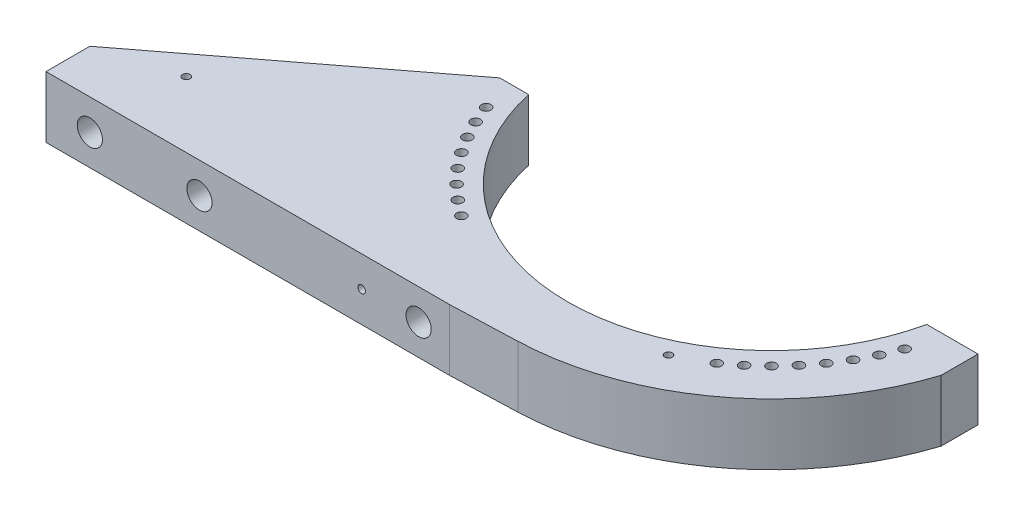
ISO-10303-21;
HEADER;
FILE_DESCRIPTION(('STEP AP214'),'2;1');
FILE_NAME('part.step','',(''),(''),'','','');
FILE_SCHEMA(('AUTOMOTIVE_DESIGN { 1 0 10303 214 1 1 1 1 }'));
ENDSEC;
DATA;
#1=APPLICATION_CONTEXT('core data for automotive mechanical design processes');
#2=APPLICATION_PROTOCOL_DEFINITION('international standard','automotive_design',2000,#1);
#3=PRODUCT_CONTEXT('',#1,'mechanical');
#4=PRODUCT('Part','Part','',(#3));
#5=PRODUCT_RELATED_PRODUCT_CATEGORY('part','',(#4));
#6=PRODUCT_DEFINITION_FORMATION('','',#4);
#7=PRODUCT_DEFINITION_CONTEXT('part definition',#1,'design');
#8=PRODUCT_DEFINITION('design','',#6,#7);
#9=PRODUCT_DEFINITION_SHAPE('','',#8);
#10=(LENGTH_UNIT() NAMED_UNIT(*) SI_UNIT(.MILLI.,.METRE.));
#11=(NAMED_UNIT(*) PLANE_ANGLE_UNIT() SI_UNIT($,.RADIAN.));
#12=(NAMED_UNIT(*) SI_UNIT($,.STERADIAN.) SOLID_ANGLE_UNIT());
#13=UNCERTAINTY_MEASURE_WITH_UNIT(LENGTH_MEASURE(1.E-05),#10,'distance_accuracy_value','');
#14=(GEOMETRIC_REPRESENTATION_CONTEXT(3) GLOBAL_UNCERTAINTY_ASSIGNED_CONTEXT((#13)) GLOBAL_UNIT_ASSIGNED_CONTEXT((#10,
#11,#12)) REPRESENTATION_CONTEXT('',''));
#15=CARTESIAN_POINT('',(0.,0.,0.));
#16=DIRECTION('',(0.,0.,1.));
#17=DIRECTION('',(1.,0.,0.));
#18=AXIS2_PLACEMENT_3D('',#15,#16,#17);
#19=CARTESIAN_POINT('',(-1050.,140.,100.));
#20=DIRECTION('',(0.,0.,-1.));
#21=DIRECTION('',(-1.,0.,0.));
#22=AXIS2_PLACEMENT_3D('',#19,#20,#21);
#23=PLANE('',#22);
#24=DIRECTION('',(1.,0.,0.));
#25=VECTOR('',#24,1.);
#26=CARTESIAN_POINT('',(-1050.,0.,100.));
#27=LINE('',#26,#25);
#28=CARTESIAN_POINT('',(-520.,0.,100.));
#29=VERTEX_POINT('',#28);
#30=CARTESIAN_POINT('',(-454.120028186382,0.,100.));
#31=VERTEX_POINT('',#30);
#32=EDGE_CURVE('E121',#29,#31,#27,.T.);
#33=ORIENTED_EDGE('',*,*,#32,.F.);
#34=DIRECTION('',(0.,-1.,0.));
#35=VECTOR('',#34,1.);
#36=CARTESIAN_POINT('',(-520.,2019.18919371118,100.));
#37=LINE('',#36,#35);
#38=CARTESIAN_POINT('',(-520.,140.,100.));
#39=VERTEX_POINT('',#38);
#40=EDGE_CURVE('E122',#39,#29,#37,.T.);
#41=ORIENTED_EDGE('',*,*,#40,.F.);
#42=DIRECTION('',(1.,0.,0.));
#43=VECTOR('',#42,1.);
#44=CARTESIAN_POINT('',(-1050.,140.,100.));
#45=LINE('',#44,#43);
#46=CARTESIAN_POINT('',(-454.120028186382,140.,100.));
#47=VERTEX_POINT('',#46);
#48=EDGE_CURVE('E336',#39,#47,#45,.T.);
#49=ORIENTED_EDGE('',*,*,#48,.T.);
#50=DIRECTION('',(0.,-1.,0.));
#51=VECTOR('',#50,1.);
#52=CARTESIAN_POINT('',(-454.120028186382,140.,100.));
#53=LINE('',#52,#51);
#54=EDGE_CURVE('E25',#47,#31,#53,.T.);
#55=ORIENTED_EDGE('',*,*,#54,.T.);
#56=EDGE_LOOP('',(#33,#41,#49,#55));
#57=FACE_BOUND('',#56,.T.);
#58=ADVANCED_FACE('F18',(#57),#23,.T.);
#59=CARTESIAN_POINT('',(-1050.,140.,100.));
#60=DIRECTION('',(-1.,0.,0.));
#61=DIRECTION('',(0.,0.,1.));
#62=AXIS2_PLACEMENT_3D('',#59,#60,#61);
#63=PLANE('',#62);
#64=DIRECTION('',(0.,0.,-1.));
#65=VECTOR('',#64,1.);
#66=CARTESIAN_POINT('',(-1050.,140.,100.));
#67=LINE('',#66,#65);
#68=CARTESIAN_POINT('',(-1050.,140.,605.));
#69=VERTEX_POINT('',#68);
#70=CARTESIAN_POINT('',(-1050.,140.,505.));
#71=VERTEX_POINT('',#70);
#72=EDGE_CURVE('E151',#69,#71,#67,.T.);
#73=ORIENTED_EDGE('',*,*,#72,.T.);
#74=DIRECTION('',(0.,-1.,0.));
#75=VECTOR('',#74,1.);
#76=CARTESIAN_POINT('',(-1050.,2019.18919371118,505.));
#77=LINE('',#76,#75);
#78=CARTESIAN_POINT('',(-1050.,0.,505.));
#79=VERTEX_POINT('',#78);
#80=EDGE_CURVE('E242',#71,#79,#77,.T.);
#81=ORIENTED_EDGE('',*,*,#80,.T.);
#82=DIRECTION('',(0.,0.,-1.));
#83=VECTOR('',#82,1.);
#84=CARTESIAN_POINT('',(-1050.,0.,100.));
#85=LINE('',#84,#83);
#86=CARTESIAN_POINT('',(-1050.,0.,605.));
#87=VERTEX_POINT('',#86);
#88=EDGE_CURVE('E145',#87,#79,#85,.T.);
#89=ORIENTED_EDGE('',*,*,#88,.F.);
#90=DIRECTION('',(0.,-1.,0.));
#91=VECTOR('',#90,1.);
#92=CARTESIAN_POINT('',(-1050.,140.,605.));
#93=LINE('',#92,#91);
#94=EDGE_CURVE('E147',#69,#87,#93,.T.);
#95=ORIENTED_EDGE('',*,*,#94,.F.);
#96=EDGE_LOOP('',(#73,#81,#89,#95));
#97=FACE_BOUND('',#96,.T.);
#98=ADVANCED_FACE('F111',(#97),#63,.T.);
#99=CARTESIAN_POINT('',(0.,140.,0.));
#100=DIRECTION('',(0.,1.,0.));
#101=DIRECTION('',(0.,0.,1.));
#102=AXIS2_PLACEMENT_3D('',#99,#100,#101);
#103=PLANE('',#102);
#104=CARTESIAN_POINT('',(220.,140.,455.));
#105=DIRECTION('',(0.,1.,0.));
#106=DIRECTION('',(0.,0.,1.));
#107=AXIS2_PLACEMENT_3D('',#104,#105,#106);
#108=CIRCLE('',#107,8.647);
#109=CARTESIAN_POINT('',(220.,140.,463.647));
#110=VERTEX_POINT('',#109);
#111=EDGE_CURVE('E386',#110,#110,#108,.T.);
#112=ORIENTED_EDGE('',*,*,#111,.F.);
#113=EDGE_LOOP('',(#112));
#114=FACE_BOUND('',#113,.T.);
#115=CARTESIAN_POINT('',(-880.,140.,455.));
#116=DIRECTION('',(0.,1.,0.));
#117=DIRECTION('',(0.,0.,1.));
#118=AXIS2_PLACEMENT_3D('',#115,#116,#117);
#119=CIRCLE('',#118,8.647);
#120=CARTESIAN_POINT('',(-880.,140.,463.647));
#121=VERTEX_POINT('',#120);
#122=EDGE_CURVE('E373',#121,#121,#119,.T.);
#123=ORIENTED_EDGE('',*,*,#122,.F.);
#124=EDGE_LOOP('',(#123));
#125=FACE_BOUND('',#124,.T.);
#126=DIRECTION('',(0.,0.,1.));
#127=VECTOR('',#126,1.);
#128=CARTESIAN_POINT('',(571.,140.,7.52182918192619E-13));
#129=LINE('',#128,#127);
#130=CARTESIAN_POINT('',(571.,140.,100.));
#131=VERTEX_POINT('',#130);
#132=CARTESIAN_POINT('',(571.,140.,184.279678749448));
#133=VERTEX_POINT('',#132);
#134=EDGE_CURVE('E360',#131,#133,#129,.T.);
#135=ORIENTED_EDGE('',*,*,#134,.F.);
#136=DIRECTION('',(1.,0.,0.));
#137=VECTOR('',#136,1.);
#138=CARTESIAN_POINT('',(454.120028186382,140.,100.));
#139=LINE('',#138,#137);
#140=CARTESIAN_POINT('',(454.120028186382,140.,100.));
#141=VERTEX_POINT('',#140);
#142=EDGE_CURVE('E335',#141,#131,#139,.T.);
#143=ORIENTED_EDGE('',*,*,#142,.F.);
#144=CARTESIAN_POINT('',(0.,140.,0.));
#145=DIRECTION('',(0.,1.,0.));
#146=DIRECTION('',(1.,0.,0.));
#147=AXIS2_PLACEMENT_3D('',#144,#145,#146);
#148=CIRCLE('',#147,465.);
#149=EDGE_CURVE('E157',#47,#141,#148,.T.);
#150=ORIENTED_EDGE('',*,*,#149,.F.);
#151=ORIENTED_EDGE('',*,*,#48,.F.);
#152=DIRECTION('',(-0.794570551349653,0.,0.607171836408697));
#153=VECTOR('',#152,1.);
#154=CARTESIAN_POINT('',(-143.457886160589,140.,-187.735011518795));
#155=LINE('',#154,#153);
#156=EDGE_CURVE('E40',#39,#71,#155,.T.);
#157=ORIENTED_EDGE('',*,*,#156,.T.);
#158=ORIENTED_EDGE('',*,*,#72,.F.);
#159=DIRECTION('',(-1.,0.,0.));
#160=VECTOR('',#159,1.);
#161=CARTESIAN_POINT('',(-1050.,140.,605.));
#162=LINE('',#161,#160);
#163=CARTESIAN_POINT('',(-130.,140.,605.));
#164=VERTEX_POINT('',#163);
#165=EDGE_CURVE('E338',#164,#69,#162,.T.);
#166=ORIENTED_EDGE('',*,*,#165,.F.);
#167=DIRECTION('',(-0.99936881924305,0.,0.0355241203234221));
#168=VECTOR('',#167,1.);
#169=CARTESIAN_POINT('',(21.3144721940532,140.,599.62129154583));
#170=LINE('',#169,#168);
#171=CARTESIAN_POINT('',(21.3144721940539,140.,599.62129154583));
#172=VERTEX_POINT('',#171);
#173=EDGE_CURVE('E362',#172,#164,#170,.T.);
#174=ORIENTED_EDGE('',*,*,#173,.F.);
#175=CARTESIAN_POINT('',(0.,140.,0.));
#176=DIRECTION('',(0.,1.,0.));
#177=DIRECTION('',(0.,0.,1.));
#178=AXIS2_PLACEMENT_3D('',#175,#176,#177);
#179=CIRCLE('',#178,600.);
#180=EDGE_CURVE('E358',#133,#172,#179,.F.);
#181=ORIENTED_EDGE('',*,*,#180,.F.);
#182=EDGE_LOOP('',(#135,#143,#150,#151,#157,#158,#166,#174,#181));
#183=FACE_BOUND('',#182,.T.);
#184=CARTESIAN_POINT('',(477.363851359241,140.,173.74623280944));
#185=DIRECTION('',(0.,1.,0.));
#186=DIRECTION('',(0.,0.,1.));
#187=AXIS2_PLACEMENT_3D('',#184,#185,#186);
#188=CIRCLE('',#187,11.);
#189=CARTESIAN_POINT('',(477.363851359241,140.,184.74623280944));
#190=VERTEX_POINT('',#189);
#191=EDGE_CURVE('E317',#190,#190,#188,.T.);
#192=ORIENTED_EDGE('',*,*,#191,.F.);
#193=EDGE_LOOP('',(#192));
#194=FACE_BOUND('',#193,.T.);
#195=CARTESIAN_POINT('',(460.404355814618,140.,214.690076964276));
#196=DIRECTION('',(0.,1.,0.));
#197=DIRECTION('',(0.,0.,1.));
#198=AXIS2_PLACEMENT_3D('',#195,#196,#197);
#199=CIRCLE('',#198,11.);
#200=CARTESIAN_POINT('',(460.404355814618,140.,225.690076964276));
#201=VERTEX_POINT('',#200);
#202=EDGE_CURVE('E312',#201,#201,#199,.T.);
#203=ORIENTED_EDGE('',*,*,#202,.F.);
#204=EDGE_LOOP('',(#203));
#205=FACE_BOUND('',#204,.T.);
#206=CARTESIAN_POINT('',(439.940905122494,140.,254.));
#207=DIRECTION('',(0.,1.,0.));
#208=DIRECTION('',(0.,0.,1.));
#209=AXIS2_PLACEMENT_3D('',#206,#207,#208);
#210=CIRCLE('',#209,11.);
#211=CARTESIAN_POINT('',(439.940905122494,140.,265.));
#212=VERTEX_POINT('',#211);
#213=EDGE_CURVE('E307',#212,#212,#210,.T.);
#214=ORIENTED_EDGE('',*,*,#213,.F.);
#215=EDGE_LOOP('',(#214));
#216=FACE_BOUND('',#215,.T.);
#217=CARTESIAN_POINT('',(416.129238498807,140.,291.376829666333));
#218=DIRECTION('',(0.,1.,0.));
#219=DIRECTION('',(0.,0.,1.));
#220=AXIS2_PLACEMENT_3D('',#217,#218,#219);
#221=CIRCLE('',#220,11.);
#222=CARTESIAN_POINT('',(416.129238498807,140.,302.376829666333));
#223=VERTEX_POINT('',#222);
#224=EDGE_CURVE('E302',#223,#223,#221,.T.);
#225=ORIENTED_EDGE('',*,*,#224,.F.);
#226=EDGE_LOOP('',(#225));
#227=FACE_BOUND('',#226,.T.);
#228=CARTESIAN_POINT('',(389.150577104439,140.,326.536105720764));
#229=DIRECTION('',(0.,1.,0.));
#230=DIRECTION('',(0.,0.,1.));
#231=AXIS2_PLACEMENT_3D('',#228,#229,#230);
#232=CIRCLE('',#231,11.);
#233=CARTESIAN_POINT('',(389.150577104439,140.,337.536105720764));
#234=VERTEX_POINT('',#233);
#235=EDGE_CURVE('E297',#234,#234,#232,.T.);
#236=ORIENTED_EDGE('',*,*,#235,.F.);
#237=EDGE_LOOP('',(#236));
#238=FACE_BOUND('',#237,.T.);
#239=CARTESIAN_POINT('',(359.210244842764,140.,359.210244842768));
#240=DIRECTION('',(0.,1.,0.));
#241=DIRECTION('',(0.,0.,1.));
#242=AXIS2_PLACEMENT_3D('',#239,#240,#241);
#243=CIRCLE('',#242,11.);
#244=CARTESIAN_POINT('',(359.210244842764,140.,370.210244842768));
#245=VERTEX_POINT('',#244);
#246=EDGE_CURVE('E292',#245,#245,#243,.T.);
#247=ORIENTED_EDGE('',*,*,#246,.F.);
#248=EDGE_LOOP('',(#247));
#249=FACE_BOUND('',#248,.T.);
#250=CARTESIAN_POINT('',(326.536105720759,140.,389.150577104444));
#251=DIRECTION('',(0.,1.,0.));
#252=DIRECTION('',(0.,0.,1.));
#253=AXIS2_PLACEMENT_3D('',#250,#251,#252);
#254=CIRCLE('',#253,11.);
#255=CARTESIAN_POINT('',(326.536105720759,140.,400.150577104444));
#256=VERTEX_POINT('',#255);
#257=EDGE_CURVE('E287',#256,#256,#254,.T.);
#258=ORIENTED_EDGE('',*,*,#257,.F.);
#259=EDGE_LOOP('',(#258));
#260=FACE_BOUND('',#259,.T.);
#261=CARTESIAN_POINT('',(291.376829666328,140.,416.12923849881));
#262=DIRECTION('',(0.,1.,0.));
#263=DIRECTION('',(0.,0.,1.));
#264=AXIS2_PLACEMENT_3D('',#261,#262,#263);
#265=CIRCLE('',#264,11.);
#266=CARTESIAN_POINT('',(291.376829666328,140.,427.129238498811));
#267=VERTEX_POINT('',#266);
#268=EDGE_CURVE('E282',#267,#267,#265,.T.);
#269=ORIENTED_EDGE('',*,*,#268,.F.);
#270=EDGE_LOOP('',(#269));
#271=FACE_BOUND('',#270,.T.);
#272=CARTESIAN_POINT('',(-477.363851359241,140.,173.74623280944));
#273=DIRECTION('',(0.,1.,0.));
#274=DIRECTION('',(0.,0.,1.));
#275=AXIS2_PLACEMENT_3D('',#272,#273,#274);
#276=CIRCLE('',#275,11.);
#277=CARTESIAN_POINT('',(-477.363851359241,140.,184.74623280944));
#278=VERTEX_POINT('',#277);
#279=EDGE_CURVE('E277',#278,#278,#276,.T.);
#280=ORIENTED_EDGE('',*,*,#279,.F.);
#281=EDGE_LOOP('',(#280));
#282=FACE_BOUND('',#281,.T.);
#283=CARTESIAN_POINT('',(-460.404355814618,140.,214.690076964276));
#284=DIRECTION('',(0.,1.,0.));
#285=DIRECTION('',(0.,0.,1.));
#286=AXIS2_PLACEMENT_3D('',#283,#284,#285);
#287=CIRCLE('',#286,11.);
#288=CARTESIAN_POINT('',(-460.404355814618,140.,225.690076964276));
#289=VERTEX_POINT('',#288);
#290=EDGE_CURVE('E272',#289,#289,#287,.T.);
#291=ORIENTED_EDGE('',*,*,#290,.F.);
#292=EDGE_LOOP('',(#291));
#293=FACE_BOUND('',#292,.T.);
#294=CARTESIAN_POINT('',(-439.940905122494,140.,254.));
#295=DIRECTION('',(0.,1.,0.));
#296=DIRECTION('',(0.,0.,1.));
#297=AXIS2_PLACEMENT_3D('',#294,#295,#296);
#298=CIRCLE('',#297,11.);
#299=CARTESIAN_POINT('',(-439.940905122494,140.,265.));
#300=VERTEX_POINT('',#299);
#301=EDGE_CURVE('E267',#300,#300,#298,.T.);
#302=ORIENTED_EDGE('',*,*,#301,.F.);
#303=EDGE_LOOP('',(#302));
#304=FACE_BOUND('',#303,.T.);
#305=CARTESIAN_POINT('',(-416.129238498808,140.,291.376829666332));
#306=DIRECTION('',(0.,1.,0.));
#307=DIRECTION('',(0.,0.,1.));
#308=AXIS2_PLACEMENT_3D('',#305,#306,#307);
#309=CIRCLE('',#308,11.);
#310=CARTESIAN_POINT('',(-416.129238498808,140.,302.376829666332));
#311=VERTEX_POINT('',#310);
#312=EDGE_CURVE('E262',#311,#311,#309,.T.);
#313=ORIENTED_EDGE('',*,*,#312,.F.);
#314=EDGE_LOOP('',(#313));
#315=FACE_BOUND('',#314,.T.);
#316=CARTESIAN_POINT('',(-389.150577104441,140.,326.536105720763));
#317=DIRECTION('',(0.,1.,0.));
#318=DIRECTION('',(0.,0.,1.));
#319=AXIS2_PLACEMENT_3D('',#316,#317,#318);
#320=CIRCLE('',#319,11.);
#321=CARTESIAN_POINT('',(-389.150577104441,140.,337.536105720763));
#322=VERTEX_POINT('',#321);
#323=EDGE_CURVE('E257',#322,#322,#320,.T.);
#324=ORIENTED_EDGE('',*,*,#323,.F.);
#325=EDGE_LOOP('',(#324));
#326=FACE_BOUND('',#325,.T.);
#327=CARTESIAN_POINT('',(-359.210244842766,140.,359.210244842767));
#328=DIRECTION('',(0.,1.,0.));
#329=DIRECTION('',(0.,0.,1.));
#330=AXIS2_PLACEMENT_3D('',#327,#328,#329);
#331=CIRCLE('',#330,11.);
#332=CARTESIAN_POINT('',(-359.210244842766,140.,370.210244842767));
#333=VERTEX_POINT('',#332);
#334=EDGE_CURVE('E252',#333,#333,#331,.T.);
#335=ORIENTED_EDGE('',*,*,#334,.F.);
#336=EDGE_LOOP('',(#335));
#337=FACE_BOUND('',#336,.T.);
#338=CARTESIAN_POINT('',(-326.536105720762,140.,389.150577104441));
#339=DIRECTION('',(0.,1.,0.));
#340=DIRECTION('',(0.,0.,1.));
#341=AXIS2_PLACEMENT_3D('',#338,#339,#340);
#342=CIRCLE('',#341,11.);
#343=CARTESIAN_POINT('',(-326.536105720762,140.,400.150577104441));
#344=VERTEX_POINT('',#343);
#345=EDGE_CURVE('E247',#344,#344,#342,.T.);
#346=ORIENTED_EDGE('',*,*,#345,.F.);
#347=EDGE_LOOP('',(#346));
#348=FACE_BOUND('',#347,.T.);
#349=CARTESIAN_POINT('',(-291.376829666331,140.,416.129238498808));
#350=DIRECTION('',(0.,1.,0.));
#351=DIRECTION('',(0.,0.,1.));
#352=AXIS2_PLACEMENT_3D('',#349,#350,#351);
#353=CIRCLE('',#352,11.);
#354=CARTESIAN_POINT('',(-291.376829666331,140.,427.129238498808));
#355=VERTEX_POINT('',#354);
#356=EDGE_CURVE('E236',#355,#355,#353,.T.);
#357=ORIENTED_EDGE('',*,*,#356,.F.);
#358=EDGE_LOOP('',(#357));
#359=FACE_BOUND('',#358,.T.);
#360=ADVANCED_FACE('F116',(#114,#125,#183,#194,#205,#216,#227,#238,#249,#260,#271,#282,#293,
#304,#315,#326,#337,#348,#359),#103,.T.);
#361=CARTESIAN_POINT('',(0.,0.,0.));
#362=DIRECTION('',(0.,1.,0.));
#363=DIRECTION('',(0.,0.,1.));
#364=AXIS2_PLACEMENT_3D('',#361,#362,#363);
#365=PLANE('',#364);
#366=CARTESIAN_POINT('',(220.,0.,455.));
#367=DIRECTION('',(0.,-1.,0.));
#368=DIRECTION('',(1.,0.,0.));
#369=AXIS2_PLACEMENT_3D('',#366,#367,#368);
#370=CIRCLE('',#369,8.647);
#371=CARTESIAN_POINT('',(228.647,0.,455.));
#372=VERTEX_POINT('',#371);
#373=EDGE_CURVE('E389',#372,#372,#370,.T.);
#374=ORIENTED_EDGE('',*,*,#373,.F.);
#375=EDGE_LOOP('',(#374));
#376=FACE_BOUND('',#375,.T.);
#377=CARTESIAN_POINT('',(-880.,0.,455.));
#378=DIRECTION('',(0.,-1.,0.));
#379=DIRECTION('',(1.,0.,0.));
#380=AXIS2_PLACEMENT_3D('',#377,#378,#379);
#381=CIRCLE('',#380,8.647);
#382=CARTESIAN_POINT('',(-871.353,0.,455.));
#383=VERTEX_POINT('',#382);
#384=EDGE_CURVE('E382',#383,#383,#381,.T.);
#385=ORIENTED_EDGE('',*,*,#384,.F.);
#386=EDGE_LOOP('',(#385));
#387=FACE_BOUND('',#386,.T.);
#388=DIRECTION('',(1.,0.,0.));
#389=VECTOR('',#388,1.);
#390=CARTESIAN_POINT('',(454.120028186382,0.,100.));
#391=LINE('',#390,#389);
#392=CARTESIAN_POINT('',(454.120028186382,0.,100.));
#393=VERTEX_POINT('',#392);
#394=CARTESIAN_POINT('',(571.,0.,100.));
#395=VERTEX_POINT('',#394);
#396=EDGE_CURVE('E138',#393,#395,#391,.T.);
#397=ORIENTED_EDGE('',*,*,#396,.T.);
#398=DIRECTION('',(0.,0.,-1.));
#399=VECTOR('',#398,1.);
#400=CARTESIAN_POINT('',(571.,0.,184.279678749448));
#401=LINE('',#400,#399);
#402=CARTESIAN_POINT('',(571.,0.,184.279678749448));
#403=VERTEX_POINT('',#402);
#404=EDGE_CURVE('E370',#403,#395,#401,.T.);
#405=ORIENTED_EDGE('',*,*,#404,.F.);
#406=CARTESIAN_POINT('',(0.,0.,0.));
#407=DIRECTION('',(0.,1.,0.));
#408=DIRECTION('',(1.,0.,0.));
#409=AXIS2_PLACEMENT_3D('',#406,#407,#408);
#410=CIRCLE('',#409,600.);
#411=CARTESIAN_POINT('',(21.3144721940539,0.,599.62129154583));
#412=VERTEX_POINT('',#411);
#413=EDGE_CURVE('E369',#412,#403,#410,.T.);
#414=ORIENTED_EDGE('',*,*,#413,.F.);
#415=DIRECTION('',(0.99936881924305,0.,-0.0355241203234221));
#416=VECTOR('',#415,1.);
#417=CARTESIAN_POINT('',(-130.,0.,605.));
#418=LINE('',#417,#416);
#419=CARTESIAN_POINT('',(-130.,0.,605.));
#420=VERTEX_POINT('',#419);
#421=EDGE_CURVE('E372',#420,#412,#418,.T.);
#422=ORIENTED_EDGE('',*,*,#421,.F.);
#423=DIRECTION('',(-1.,0.,0.));
#424=VECTOR('',#423,1.);
#425=CARTESIAN_POINT('',(-1050.,0.,605.));
#426=LINE('',#425,#424);
#427=EDGE_CURVE('E165',#420,#87,#426,.T.);
#428=ORIENTED_EDGE('',*,*,#427,.T.);
#429=ORIENTED_EDGE('',*,*,#88,.T.);
#430=DIRECTION('',(0.794570551349653,0.,-0.607171836408697));
#431=VECTOR('',#430,1.);
#432=CARTESIAN_POINT('',(-1050.,0.,505.));
#433=LINE('',#432,#431);
#434=EDGE_CURVE('E351',#79,#29,#433,.T.);
#435=ORIENTED_EDGE('',*,*,#434,.T.);
#436=ORIENTED_EDGE('',*,*,#32,.T.);
#437=CARTESIAN_POINT('',(0.,0.,0.));
#438=DIRECTION('',(0.,1.,0.));
#439=DIRECTION('',(1.,0.,0.));
#440=AXIS2_PLACEMENT_3D('',#437,#438,#439);
#441=CIRCLE('',#440,465.);
#442=EDGE_CURVE('E130',#31,#393,#441,.T.);
#443=ORIENTED_EDGE('',*,*,#442,.T.);
#444=EDGE_LOOP('',(#397,#405,#414,#422,#428,#429,#435,#436,#443));
#445=FACE_BOUND('',#444,.T.);
#446=CARTESIAN_POINT('',(477.363851359241,0.,173.74623280944));
#447=DIRECTION('',(0.,-1.,0.));
#448=DIRECTION('',(1.,0.,0.));
#449=AXIS2_PLACEMENT_3D('',#446,#447,#448);
#450=CIRCLE('',#449,11.);
#451=CARTESIAN_POINT('',(488.363851359241,0.,173.74623280944));
#452=VERTEX_POINT('',#451);
#453=EDGE_CURVE('E175',#452,#452,#450,.T.);
#454=ORIENTED_EDGE('',*,*,#453,.F.);
#455=EDGE_LOOP('',(#454));
#456=FACE_BOUND('',#455,.T.);
#457=CARTESIAN_POINT('',(460.404355814618,0.,214.690076964276));
#458=DIRECTION('',(0.,-1.,0.));
#459=DIRECTION('',(1.,0.,0.));
#460=AXIS2_PLACEMENT_3D('',#457,#458,#459);
#461=CIRCLE('',#460,11.);
#462=CARTESIAN_POINT('',(471.404355814618,0.,214.690076964276));
#463=VERTEX_POINT('',#462);
#464=EDGE_CURVE('E179',#463,#463,#461,.T.);
#465=ORIENTED_EDGE('',*,*,#464,.F.);
#466=EDGE_LOOP('',(#465));
#467=FACE_BOUND('',#466,.T.);
#468=CARTESIAN_POINT('',(439.940905122494,0.,254.));
#469=DIRECTION('',(0.,-1.,0.));
#470=DIRECTION('',(1.,0.,0.));
#471=AXIS2_PLACEMENT_3D('',#468,#469,#470);
#472=CIRCLE('',#471,11.);
#473=CARTESIAN_POINT('',(450.940905122494,0.,254.));
#474=VERTEX_POINT('',#473);
#475=EDGE_CURVE('E183',#474,#474,#472,.T.);
#476=ORIENTED_EDGE('',*,*,#475,.F.);
#477=EDGE_LOOP('',(#476));
#478=FACE_BOUND('',#477,.T.);
#479=CARTESIAN_POINT('',(416.129238498807,0.,291.376829666333));
#480=DIRECTION('',(0.,-1.,0.));
#481=DIRECTION('',(1.,0.,0.));
#482=AXIS2_PLACEMENT_3D('',#479,#480,#481);
#483=CIRCLE('',#482,11.);
#484=CARTESIAN_POINT('',(427.129238498807,0.,291.376829666333));
#485=VERTEX_POINT('',#484);
#486=EDGE_CURVE('E187',#485,#485,#483,.T.);
#487=ORIENTED_EDGE('',*,*,#486,.F.);
#488=EDGE_LOOP('',(#487));
#489=FACE_BOUND('',#488,.T.);
#490=CARTESIAN_POINT('',(389.150577104439,0.,326.536105720764));
#491=DIRECTION('',(0.,-1.,0.));
#492=DIRECTION('',(1.,0.,0.));
#493=AXIS2_PLACEMENT_3D('',#490,#491,#492);
#494=CIRCLE('',#493,11.);
#495=CARTESIAN_POINT('',(400.150577104439,0.,326.536105720764));
#496=VERTEX_POINT('',#495);
#497=EDGE_CURVE('E191',#496,#496,#494,.T.);
#498=ORIENTED_EDGE('',*,*,#497,.F.);
#499=EDGE_LOOP('',(#498));
#500=FACE_BOUND('',#499,.T.);
#501=CARTESIAN_POINT('',(359.210244842764,0.,359.210244842768));
#502=DIRECTION('',(0.,-1.,0.));
#503=DIRECTION('',(1.,0.,0.));
#504=AXIS2_PLACEMENT_3D('',#501,#502,#503);
#505=CIRCLE('',#504,11.);
#506=CARTESIAN_POINT('',(370.210244842764,0.,359.210244842768));
#507=VERTEX_POINT('',#506);
#508=EDGE_CURVE('E195',#507,#507,#505,.T.);
#509=ORIENTED_EDGE('',*,*,#508,.F.);
#510=EDGE_LOOP('',(#509));
#511=FACE_BOUND('',#510,.T.);
#512=CARTESIAN_POINT('',(326.536105720759,0.,389.150577104444));
#513=DIRECTION('',(0.,-1.,0.));
#514=DIRECTION('',(1.,0.,0.));
#515=AXIS2_PLACEMENT_3D('',#512,#513,#514);
#516=CIRCLE('',#515,11.);
#517=CARTESIAN_POINT('',(337.536105720759,0.,389.150577104444));
#518=VERTEX_POINT('',#517);
#519=EDGE_CURVE('E199',#518,#518,#516,.T.);
#520=ORIENTED_EDGE('',*,*,#519,.F.);
#521=EDGE_LOOP('',(#520));
#522=FACE_BOUND('',#521,.T.);
#523=CARTESIAN_POINT('',(291.376829666328,0.,416.12923849881));
#524=DIRECTION('',(0.,-1.,0.));
#525=DIRECTION('',(1.,0.,0.));
#526=AXIS2_PLACEMENT_3D('',#523,#524,#525);
#527=CIRCLE('',#526,11.);
#528=CARTESIAN_POINT('',(302.376829666328,0.,416.12923849881));
#529=VERTEX_POINT('',#528);
#530=EDGE_CURVE('E203',#529,#529,#527,.T.);
#531=ORIENTED_EDGE('',*,*,#530,.F.);
#532=EDGE_LOOP('',(#531));
#533=FACE_BOUND('',#532,.T.);
#534=CARTESIAN_POINT('',(-477.363851359241,0.,173.74623280944));
#535=DIRECTION('',(0.,-1.,0.));
#536=DIRECTION('',(1.,0.,0.));
#537=AXIS2_PLACEMENT_3D('',#534,#535,#536);
#538=CIRCLE('',#537,11.);
#539=CARTESIAN_POINT('',(-466.363851359241,0.,173.74623280944));
#540=VERTEX_POINT('',#539);
#541=EDGE_CURVE('E207',#540,#540,#538,.T.);
#542=ORIENTED_EDGE('',*,*,#541,.F.);
#543=EDGE_LOOP('',(#542));
#544=FACE_BOUND('',#543,.T.);
#545=CARTESIAN_POINT('',(-460.404355814618,0.,214.690076964276));
#546=DIRECTION('',(0.,-1.,0.));
#547=DIRECTION('',(1.,0.,0.));
#548=AXIS2_PLACEMENT_3D('',#545,#546,#547);
#549=CIRCLE('',#548,11.);
#550=CARTESIAN_POINT('',(-449.404355814618,0.,214.690076964276));
#551=VERTEX_POINT('',#550);
#552=EDGE_CURVE('E211',#551,#551,#549,.T.);
#553=ORIENTED_EDGE('',*,*,#552,.F.);
#554=EDGE_LOOP('',(#553));
#555=FACE_BOUND('',#554,.T.);
#556=CARTESIAN_POINT('',(-439.940905122494,0.,254.));
#557=DIRECTION('',(0.,-1.,0.));
#558=DIRECTION('',(1.,0.,0.));
#559=AXIS2_PLACEMENT_3D('',#556,#557,#558);
#560=CIRCLE('',#559,11.);
#561=CARTESIAN_POINT('',(-428.940905122494,0.,254.));
#562=VERTEX_POINT('',#561);
#563=EDGE_CURVE('E215',#562,#562,#560,.T.);
#564=ORIENTED_EDGE('',*,*,#563,.F.);
#565=EDGE_LOOP('',(#564));
#566=FACE_BOUND('',#565,.T.);
#567=CARTESIAN_POINT('',(-416.129238498808,0.,291.376829666332));
#568=DIRECTION('',(0.,-1.,0.));
#569=DIRECTION('',(1.,0.,0.));
#570=AXIS2_PLACEMENT_3D('',#567,#568,#569);
#571=CIRCLE('',#570,11.);
#572=CARTESIAN_POINT('',(-405.129238498808,0.,291.376829666332));
#573=VERTEX_POINT('',#572);
#574=EDGE_CURVE('E219',#573,#573,#571,.T.);
#575=ORIENTED_EDGE('',*,*,#574,.F.);
#576=EDGE_LOOP('',(#575));
#577=FACE_BOUND('',#576,.T.);
#578=CARTESIAN_POINT('',(-389.150577104441,0.,326.536105720763));
#579=DIRECTION('',(0.,-1.,0.));
#580=DIRECTION('',(1.,0.,0.));
#581=AXIS2_PLACEMENT_3D('',#578,#579,#580);
#582=CIRCLE('',#581,11.);
#583=CARTESIAN_POINT('',(-378.150577104441,0.,326.536105720763));
#584=VERTEX_POINT('',#583);
#585=EDGE_CURVE('E223',#584,#584,#582,.T.);
#586=ORIENTED_EDGE('',*,*,#585,.F.);
#587=EDGE_LOOP('',(#586));
#588=FACE_BOUND('',#587,.T.);
#589=CARTESIAN_POINT('',(-359.210244842766,0.,359.210244842767));
#590=DIRECTION('',(0.,-1.,0.));
#591=DIRECTION('',(1.,0.,0.));
#592=AXIS2_PLACEMENT_3D('',#589,#590,#591);
#593=CIRCLE('',#592,11.);
#594=CARTESIAN_POINT('',(-348.210244842766,0.,359.210244842767));
#595=VERTEX_POINT('',#594);
#596=EDGE_CURVE('E227',#595,#595,#593,.T.);
#597=ORIENTED_EDGE('',*,*,#596,.F.);
#598=EDGE_LOOP('',(#597));
#599=FACE_BOUND('',#598,.T.);
#600=CARTESIAN_POINT('',(-326.536105720762,0.,389.150577104441));
#601=DIRECTION('',(0.,-1.,0.));
#602=DIRECTION('',(1.,0.,0.));
#603=AXIS2_PLACEMENT_3D('',#600,#601,#602);
#604=CIRCLE('',#603,11.);
#605=CARTESIAN_POINT('',(-315.536105720761,0.,389.150577104441));
#606=VERTEX_POINT('',#605);
#607=EDGE_CURVE('E231',#606,#606,#604,.T.);
#608=ORIENTED_EDGE('',*,*,#607,.F.);
#609=EDGE_LOOP('',(#608));
#610=FACE_BOUND('',#609,.T.);
#611=CARTESIAN_POINT('',(-291.376829666331,0.,416.129238498808));
#612=DIRECTION('',(0.,-1.,0.));
#613=DIRECTION('',(1.,0.,0.));
#614=AXIS2_PLACEMENT_3D('',#611,#612,#613);
#615=CIRCLE('',#614,11.);
#616=CARTESIAN_POINT('',(-280.376829666331,0.,416.129238498808));
#617=VERTEX_POINT('',#616);
#618=EDGE_CURVE('E234',#617,#617,#615,.T.);
#619=ORIENTED_EDGE('',*,*,#618,.F.);
#620=EDGE_LOOP('',(#619));
#621=FACE_BOUND('',#620,.T.);
#622=ADVANCED_FACE('F167',(#376,#387,#445,#456,#467,#478,#489,#500,#511,#522,#533,#544,#555,
#566,#577,#588,#599,#610,#621),#365,.F.);
#623=CARTESIAN_POINT('',(0.,140.,0.));
#624=DIRECTION('',(0.,-1.,0.));
#625=DIRECTION('',(0.,0.,-1.));
#626=AXIS2_PLACEMENT_3D('',#623,#624,#625);
#627=CYLINDRICAL_SURFACE('',#626,465.);
#628=ORIENTED_EDGE('',*,*,#442,.F.);
#629=ORIENTED_EDGE('',*,*,#54,.F.);
#630=ORIENTED_EDGE('',*,*,#149,.T.);
#631=DIRECTION('',(0.,-1.,0.));
#632=VECTOR('',#631,1.);
#633=CARTESIAN_POINT('',(454.120028186382,140.,100.));
#634=LINE('',#633,#632);
#635=EDGE_CURVE('E150',#141,#393,#634,.T.);
#636=ORIENTED_EDGE('',*,*,#635,.T.);
#637=EDGE_LOOP('',(#628,#629,#630,#636));
#638=FACE_BOUND('',#637,.T.);
#639=ADVANCED_FACE('F155',(#638),#627,.F.);
#640=CARTESIAN_POINT('',(454.120028186382,140.,100.));
#641=DIRECTION('',(0.,0.,-1.));
#642=DIRECTION('',(-1.,0.,0.));
#643=AXIS2_PLACEMENT_3D('',#640,#641,#642);
#644=PLANE('',#643);
#645=DIRECTION('',(0.,-1.,0.));
#646=VECTOR('',#645,1.);
#647=CARTESIAN_POINT('',(571.,2019.18919371118,100.));
#648=LINE('',#647,#646);
#649=EDGE_CURVE('E32',#131,#395,#648,.T.);
#650=ORIENTED_EDGE('',*,*,#649,.T.);
#651=ORIENTED_EDGE('',*,*,#396,.F.);
#652=ORIENTED_EDGE('',*,*,#635,.F.);
#653=ORIENTED_EDGE('',*,*,#142,.T.);
#654=EDGE_LOOP('',(#650,#651,#652,#653));
#655=FACE_BOUND('',#654,.T.);
#656=ADVANCED_FACE('F162',(#655),#644,.T.);
#657=CARTESIAN_POINT('',(-1050.,140.,605.));
#658=DIRECTION('',(0.,0.,1.));
#659=DIRECTION('',(1.,0.,0.));
#660=AXIS2_PLACEMENT_3D('',#657,#658,#659);
#661=PLANE('',#660);
#662=CARTESIAN_POINT('',(-330.,70.,605.));
#663=DIRECTION('',(0.,0.,-1.));
#664=DIRECTION('',(0.,-1.,0.));
#665=AXIS2_PLACEMENT_3D('',#662,#663,#664);
#666=CIRCLE('',#665,8.647);
#667=CARTESIAN_POINT('',(-330.,61.353,605.));
#668=VERTEX_POINT('',#667);
#669=EDGE_CURVE('E393',#668,#668,#666,.T.);
#670=ORIENTED_EDGE('',*,*,#669,.T.);
#671=EDGE_LOOP('',(#670));
#672=FACE_BOUND('',#671,.T.);
#673=DIRECTION('',(0.,-1.,0.));
#674=VECTOR('',#673,1.);
#675=CARTESIAN_POINT('',(-130.000000000003,140.,605.));
#676=LINE('',#675,#674);
#677=EDGE_CURVE('E11',#164,#420,#676,.T.);
#678=ORIENTED_EDGE('',*,*,#677,.F.);
#679=ORIENTED_EDGE('',*,*,#165,.T.);
#680=ORIENTED_EDGE('',*,*,#94,.T.);
#681=ORIENTED_EDGE('',*,*,#427,.F.);
#682=EDGE_LOOP('',(#678,#679,#680,#681));
#683=FACE_BOUND('',#682,.T.);
#684=CARTESIAN_POINT('',(-200.,70.,605.));
#685=DIRECTION('',(0.,0.,-1.));
#686=DIRECTION('',(0.,-1.,0.));
#687=AXIS2_PLACEMENT_3D('',#684,#685,#686);
#688=CIRCLE('',#687,28.7525);
#689=CARTESIAN_POINT('',(-200.,41.2475,605.));
#690=VERTEX_POINT('',#689);
#691=EDGE_CURVE('E323',#690,#690,#688,.T.);
#692=ORIENTED_EDGE('',*,*,#691,.T.);
#693=EDGE_LOOP('',(#692));
#694=FACE_BOUND('',#693,.T.);
#695=CARTESIAN_POINT('',(-950.,70.,605.));
#696=DIRECTION('',(0.,0.,-1.));
#697=DIRECTION('',(0.,-1.,0.));
#698=AXIS2_PLACEMENT_3D('',#695,#696,#697);
#699=CIRCLE('',#698,28.7525);
#700=CARTESIAN_POINT('',(-950.,41.2475,605.));
#701=VERTEX_POINT('',#700);
#702=EDGE_CURVE('E329',#701,#701,#699,.T.);
#703=ORIENTED_EDGE('',*,*,#702,.T.);
#704=EDGE_LOOP('',(#703));
#705=FACE_BOUND('',#704,.T.);
#706=CARTESIAN_POINT('',(-700.,70.,605.));
#707=DIRECTION('',(0.,0.,-1.));
#708=DIRECTION('',(0.,-1.,0.));
#709=AXIS2_PLACEMENT_3D('',#706,#707,#708);
#710=CIRCLE('',#709,28.7525);
#711=CARTESIAN_POINT('',(-700.,41.2475,605.));
#712=VERTEX_POINT('',#711);
#713=EDGE_CURVE('E131',#712,#712,#710,.T.);
#714=ORIENTED_EDGE('',*,*,#713,.T.);
#715=EDGE_LOOP('',(#714));
#716=FACE_BOUND('',#715,.T.);
#717=ADVANCED_FACE('F401',(#672,#683,#694,#705,#716),#661,.T.);
#718=CARTESIAN_POINT('',(-700.,70.,605.));
#719=DIRECTION('',(0.,0.,-1.));
#720=DIRECTION('',(0.,-1.,0.));
#721=AXIS2_PLACEMENT_3D('',#718,#719,#720);
#722=CYLINDRICAL_SURFACE('',#721,28.7525);
#723=CARTESIAN_POINT('',(-700.,70.,502.27624494859));
#724=DIRECTION('',(0.,0.,-1.));
#725=DIRECTION('',(0.,1.,0.));
#726=AXIS2_PLACEMENT_3D('',#723,#724,#725);
#727=CIRCLE('',#726,28.7525);
#728=CARTESIAN_POINT('',(-700.,98.7525,502.27624494859));
#729=VERTEX_POINT('',#728);
#730=EDGE_CURVE('E141',#729,#729,#727,.T.);
#731=ORIENTED_EDGE('',*,*,#730,.T.);
#732=EDGE_LOOP('',(#731));
#733=FACE_BOUND('',#732,.T.);
#734=ORIENTED_EDGE('',*,*,#713,.F.);
#735=EDGE_LOOP('',(#734));
#736=FACE_BOUND('',#735,.T.);
#737=ADVANCED_FACE('F404',(#733,#736),#722,.F.);
#738=CARTESIAN_POINT('',(-700.,70.,502.27624494859));
#739=DIRECTION('',(0.,0.,1.));
#740=DIRECTION('',(0.,1.,0.));
#741=AXIS2_PLACEMENT_3D('',#738,#739,#740);
#742=CONICAL_SURFACE('',#741,28.7525,1.02974425867665);
#743=ORIENTED_EDGE('',*,*,#730,.F.);
#744=EDGE_LOOP('',(#743));
#745=FACE_BOUND('',#744,.T.);
#746=CARTESIAN_POINT('',(-700.,70.,485.));
#747=VERTEX_POINT('',#746);
#748=VERTEX_LOOP('',#747);
#749=FACE_BOUND('',#748,.T.);
#750=ADVANCED_FACE('F416',(#745,#749),#742,.F.);
#751=CARTESIAN_POINT('',(-950.,70.,605.));
#752=DIRECTION('',(0.,0.,-1.));
#753=DIRECTION('',(0.,-1.,0.));
#754=AXIS2_PLACEMENT_3D('',#751,#752,#753);
#755=CYLINDRICAL_SURFACE('',#754,28.7525);
#756=CARTESIAN_POINT('',(-950.,70.,502.27624494859));
#757=DIRECTION('',(0.,0.,-1.));
#758=DIRECTION('',(0.,1.,0.));
#759=AXIS2_PLACEMENT_3D('',#756,#757,#758);
#760=CIRCLE('',#759,28.7525);
#761=CARTESIAN_POINT('',(-950.,98.7525,502.27624494859));
#762=VERTEX_POINT('',#761);
#763=EDGE_CURVE('E326',#762,#762,#760,.T.);
#764=ORIENTED_EDGE('',*,*,#763,.T.);
#765=EDGE_LOOP('',(#764));
#766=FACE_BOUND('',#765,.T.);
#767=ORIENTED_EDGE('',*,*,#702,.F.);
#768=EDGE_LOOP('',(#767));
#769=FACE_BOUND('',#768,.T.);
#770=ADVANCED_FACE('F422',(#766,#769),#755,.F.);
#771=CARTESIAN_POINT('',(-950.,70.,502.27624494859));
#772=DIRECTION('',(0.,0.,1.));
#773=DIRECTION('',(0.,1.,0.));
#774=AXIS2_PLACEMENT_3D('',#771,#772,#773);
#775=CONICAL_SURFACE('',#774,28.7525,1.02974425867665);
#776=ORIENTED_EDGE('',*,*,#763,.F.);
#777=EDGE_LOOP('',(#776));
#778=FACE_BOUND('',#777,.T.);
#779=CARTESIAN_POINT('',(-950.,70.,485.));
#780=VERTEX_POINT('',#779);
#781=VERTEX_LOOP('',#780);
#782=FACE_BOUND('',#781,.T.);
#783=ADVANCED_FACE('F477',(#778,#782),#775,.F.);
#784=CARTESIAN_POINT('',(-200.,70.,605.));
#785=DIRECTION('',(0.,0.,-1.));
#786=DIRECTION('',(0.,-1.,0.));
#787=AXIS2_PLACEMENT_3D('',#784,#785,#786);
#788=CYLINDRICAL_SURFACE('',#787,28.7525);
#789=CARTESIAN_POINT('',(-200.,70.,502.27624494859));
#790=DIRECTION('',(0.,0.,-1.));
#791=DIRECTION('',(0.,1.,0.));
#792=AXIS2_PLACEMENT_3D('',#789,#790,#791);
#793=CIRCLE('',#792,28.7525);
#794=CARTESIAN_POINT('',(-200.,98.7525,502.27624494859));
#795=VERTEX_POINT('',#794);
#796=EDGE_CURVE('E320',#795,#795,#793,.T.);
#797=ORIENTED_EDGE('',*,*,#796,.T.);
#798=EDGE_LOOP('',(#797));
#799=FACE_BOUND('',#798,.T.);
#800=ORIENTED_EDGE('',*,*,#691,.F.);
#801=EDGE_LOOP('',(#800));
#802=FACE_BOUND('',#801,.T.);
#803=ADVANCED_FACE('F487',(#799,#802),#788,.F.);
#804=CARTESIAN_POINT('',(-200.,70.,502.27624494859));
#805=DIRECTION('',(0.,0.,1.));
#806=DIRECTION('',(0.,1.,0.));
#807=AXIS2_PLACEMENT_3D('',#804,#805,#806);
#808=CONICAL_SURFACE('',#807,28.7525,1.02974425867665);
#809=ORIENTED_EDGE('',*,*,#796,.F.);
#810=EDGE_LOOP('',(#809));
#811=FACE_BOUND('',#810,.T.);
#812=CARTESIAN_POINT('',(-200.,70.,485.));
#813=VERTEX_POINT('',#812);
#814=VERTEX_LOOP('',#813);
#815=FACE_BOUND('',#814,.T.);
#816=ADVANCED_FACE('F498',(#811,#815),#808,.F.);
#817=CARTESIAN_POINT('',(477.363851359241,2019.18919371118,173.74623280944));
#818=DIRECTION('',(0.,-1.,0.));
#819=DIRECTION('',(0.,0.,-1.));
#820=AXIS2_PLACEMENT_3D('',#817,#818,#819);
#821=CYLINDRICAL_SURFACE('',#820,11.);
#822=ORIENTED_EDGE('',*,*,#453,.T.);
#823=EDGE_LOOP('',(#822));
#824=FACE_BOUND('',#823,.T.);
#825=ORIENTED_EDGE('',*,*,#191,.T.);
#826=EDGE_LOOP('',(#825));
#827=FACE_BOUND('',#826,.T.);
#828=ADVANCED_FACE('F508',(#824,#827),#821,.F.);
#829=CARTESIAN_POINT('',(460.404355814618,2019.18919371118,214.690076964276));
#830=DIRECTION('',(0.,-1.,0.));
#831=DIRECTION('',(0.,0.,-1.));
#832=AXIS2_PLACEMENT_3D('',#829,#830,#831);
#833=CYLINDRICAL_SURFACE('',#832,11.);
#834=ORIENTED_EDGE('',*,*,#464,.T.);
#835=EDGE_LOOP('',(#834));
#836=FACE_BOUND('',#835,.T.);
#837=ORIENTED_EDGE('',*,*,#202,.T.);
#838=EDGE_LOOP('',(#837));
#839=FACE_BOUND('',#838,.T.);
#840=ADVANCED_FACE('F519',(#836,#839),#833,.F.);
#841=CARTESIAN_POINT('',(439.940905122494,2019.18919371118,254.));
#842=DIRECTION('',(0.,-1.,0.));
#843=DIRECTION('',(0.,0.,-1.));
#844=AXIS2_PLACEMENT_3D('',#841,#842,#843);
#845=CYLINDRICAL_SURFACE('',#844,11.);
#846=ORIENTED_EDGE('',*,*,#475,.T.);
#847=EDGE_LOOP('',(#846));
#848=FACE_BOUND('',#847,.T.);
#849=ORIENTED_EDGE('',*,*,#213,.T.);
#850=EDGE_LOOP('',(#849));
#851=FACE_BOUND('',#850,.T.);
#852=ADVANCED_FACE('F530',(#848,#851),#845,.F.);
#853=CARTESIAN_POINT('',(416.129238498807,2019.18919371118,291.376829666333));
#854=DIRECTION('',(0.,-1.,0.));
#855=DIRECTION('',(0.,0.,-1.));
#856=AXIS2_PLACEMENT_3D('',#853,#854,#855);
#857=CYLINDRICAL_SURFACE('',#856,11.);
#858=ORIENTED_EDGE('',*,*,#486,.T.);
#859=EDGE_LOOP('',(#858));
#860=FACE_BOUND('',#859,.T.);
#861=ORIENTED_EDGE('',*,*,#224,.T.);
#862=EDGE_LOOP('',(#861));
#863=FACE_BOUND('',#862,.T.);
#864=ADVANCED_FACE('F541',(#860,#863),#857,.F.);
#865=CARTESIAN_POINT('',(389.150577104439,2019.18919371118,326.536105720764));
#866=DIRECTION('',(0.,-1.,0.));
#867=DIRECTION('',(0.,0.,-1.));
#868=AXIS2_PLACEMENT_3D('',#865,#866,#867);
#869=CYLINDRICAL_SURFACE('',#868,11.);
#870=ORIENTED_EDGE('',*,*,#497,.T.);
#871=EDGE_LOOP('',(#870));
#872=FACE_BOUND('',#871,.T.);
#873=ORIENTED_EDGE('',*,*,#235,.T.);
#874=EDGE_LOOP('',(#873));
#875=FACE_BOUND('',#874,.T.);
#876=ADVANCED_FACE('F552',(#872,#875),#869,.F.);
#877=CARTESIAN_POINT('',(359.210244842764,2019.18919371118,359.210244842768));
#878=DIRECTION('',(0.,-1.,0.));
#879=DIRECTION('',(0.,0.,-1.));
#880=AXIS2_PLACEMENT_3D('',#877,#878,#879);
#881=CYLINDRICAL_SURFACE('',#880,11.);
#882=ORIENTED_EDGE('',*,*,#508,.T.);
#883=EDGE_LOOP('',(#882));
#884=FACE_BOUND('',#883,.T.);
#885=ORIENTED_EDGE('',*,*,#246,.T.);
#886=EDGE_LOOP('',(#885));
#887=FACE_BOUND('',#886,.T.);
#888=ADVANCED_FACE('F563',(#884,#887),#881,.F.);
#889=CARTESIAN_POINT('',(326.536105720759,2019.18919371118,389.150577104444));
#890=DIRECTION('',(0.,-1.,0.));
#891=DIRECTION('',(0.,0.,-1.));
#892=AXIS2_PLACEMENT_3D('',#889,#890,#891);
#893=CYLINDRICAL_SURFACE('',#892,11.);
#894=ORIENTED_EDGE('',*,*,#519,.T.);
#895=EDGE_LOOP('',(#894));
#896=FACE_BOUND('',#895,.T.);
#897=ORIENTED_EDGE('',*,*,#257,.T.);
#898=EDGE_LOOP('',(#897));
#899=FACE_BOUND('',#898,.T.);
#900=ADVANCED_FACE('F574',(#896,#899),#893,.F.);
#901=CARTESIAN_POINT('',(291.376829666328,2019.18919371118,416.12923849881));
#902=DIRECTION('',(0.,-1.,0.));
#903=DIRECTION('',(0.,0.,-1.));
#904=AXIS2_PLACEMENT_3D('',#901,#902,#903);
#905=CYLINDRICAL_SURFACE('',#904,11.);
#906=ORIENTED_EDGE('',*,*,#530,.T.);
#907=EDGE_LOOP('',(#906));
#908=FACE_BOUND('',#907,.T.);
#909=ORIENTED_EDGE('',*,*,#268,.T.);
#910=EDGE_LOOP('',(#909));
#911=FACE_BOUND('',#910,.T.);
#912=ADVANCED_FACE('F585',(#908,#911),#905,.F.);
#913=CARTESIAN_POINT('',(-477.363851359241,2019.18919371118,173.74623280944));
#914=DIRECTION('',(0.,-1.,0.));
#915=DIRECTION('',(0.,0.,-1.));
#916=AXIS2_PLACEMENT_3D('',#913,#914,#915);
#917=CYLINDRICAL_SURFACE('',#916,11.);
#918=ORIENTED_EDGE('',*,*,#541,.T.);
#919=EDGE_LOOP('',(#918));
#920=FACE_BOUND('',#919,.T.);
#921=ORIENTED_EDGE('',*,*,#279,.T.);
#922=EDGE_LOOP('',(#921));
#923=FACE_BOUND('',#922,.T.);
#924=ADVANCED_FACE('F596',(#920,#923),#917,.F.);
#925=CARTESIAN_POINT('',(-460.404355814618,2019.18919371118,214.690076964276));
#926=DIRECTION('',(0.,-1.,0.));
#927=DIRECTION('',(0.,0.,-1.));
#928=AXIS2_PLACEMENT_3D('',#925,#926,#927);
#929=CYLINDRICAL_SURFACE('',#928,11.);
#930=ORIENTED_EDGE('',*,*,#552,.T.);
#931=EDGE_LOOP('',(#930));
#932=FACE_BOUND('',#931,.T.);
#933=ORIENTED_EDGE('',*,*,#290,.T.);
#934=EDGE_LOOP('',(#933));
#935=FACE_BOUND('',#934,.T.);
#936=ADVANCED_FACE('F607',(#932,#935),#929,.F.);
#937=CARTESIAN_POINT('',(-439.940905122494,2019.18919371118,254.));
#938=DIRECTION('',(0.,-1.,0.));
#939=DIRECTION('',(0.,0.,-1.));
#940=AXIS2_PLACEMENT_3D('',#937,#938,#939);
#941=CYLINDRICAL_SURFACE('',#940,11.);
#942=ORIENTED_EDGE('',*,*,#563,.T.);
#943=EDGE_LOOP('',(#942));
#944=FACE_BOUND('',#943,.T.);
#945=ORIENTED_EDGE('',*,*,#301,.T.);
#946=EDGE_LOOP('',(#945));
#947=FACE_BOUND('',#946,.T.);
#948=ADVANCED_FACE('F618',(#944,#947),#941,.F.);
#949=CARTESIAN_POINT('',(-416.129238498808,2019.18919371118,291.376829666332));
#950=DIRECTION('',(0.,-1.,0.));
#951=DIRECTION('',(0.,0.,-1.));
#952=AXIS2_PLACEMENT_3D('',#949,#950,#951);
#953=CYLINDRICAL_SURFACE('',#952,11.);
#954=ORIENTED_EDGE('',*,*,#574,.T.);
#955=EDGE_LOOP('',(#954));
#956=FACE_BOUND('',#955,.T.);
#957=ORIENTED_EDGE('',*,*,#312,.T.);
#958=EDGE_LOOP('',(#957));
#959=FACE_BOUND('',#958,.T.);
#960=ADVANCED_FACE('F629',(#956,#959),#953,.F.);
#961=CARTESIAN_POINT('',(-389.150577104441,2019.18919371118,326.536105720763));
#962=DIRECTION('',(0.,-1.,0.));
#963=DIRECTION('',(0.,0.,-1.));
#964=AXIS2_PLACEMENT_3D('',#961,#962,#963);
#965=CYLINDRICAL_SURFACE('',#964,11.);
#966=ORIENTED_EDGE('',*,*,#585,.T.);
#967=EDGE_LOOP('',(#966));
#968=FACE_BOUND('',#967,.T.);
#969=ORIENTED_EDGE('',*,*,#323,.T.);
#970=EDGE_LOOP('',(#969));
#971=FACE_BOUND('',#970,.T.);
#972=ADVANCED_FACE('F640',(#968,#971),#965,.F.);
#973=CARTESIAN_POINT('',(-359.210244842766,2019.18919371118,359.210244842767));
#974=DIRECTION('',(0.,-1.,0.));
#975=DIRECTION('',(0.,0.,-1.));
#976=AXIS2_PLACEMENT_3D('',#973,#974,#975);
#977=CYLINDRICAL_SURFACE('',#976,11.);
#978=ORIENTED_EDGE('',*,*,#596,.T.);
#979=EDGE_LOOP('',(#978));
#980=FACE_BOUND('',#979,.T.);
#981=ORIENTED_EDGE('',*,*,#334,.T.);
#982=EDGE_LOOP('',(#981));
#983=FACE_BOUND('',#982,.T.);
#984=ADVANCED_FACE('F651',(#980,#983),#977,.F.);
#985=CARTESIAN_POINT('',(-326.536105720762,2019.18919371118,389.150577104441));
#986=DIRECTION('',(0.,-1.,0.));
#987=DIRECTION('',(0.,0.,-1.));
#988=AXIS2_PLACEMENT_3D('',#985,#986,#987);
#989=CYLINDRICAL_SURFACE('',#988,11.);
#990=ORIENTED_EDGE('',*,*,#607,.T.);
#991=EDGE_LOOP('',(#990));
#992=FACE_BOUND('',#991,.T.);
#993=ORIENTED_EDGE('',*,*,#345,.T.);
#994=EDGE_LOOP('',(#993));
#995=FACE_BOUND('',#994,.T.);
#996=ADVANCED_FACE('F662',(#992,#995),#989,.F.);
#997=CARTESIAN_POINT('',(-291.376829666331,2019.18919371118,416.129238498808));
#998=DIRECTION('',(0.,-1.,0.));
#999=DIRECTION('',(0.,0.,-1.));
#1000=AXIS2_PLACEMENT_3D('',#997,#998,#999);
#1001=CYLINDRICAL_SURFACE('',#1000,11.);
#1002=ORIENTED_EDGE('',*,*,#618,.T.);
#1003=EDGE_LOOP('',(#1002));
#1004=FACE_BOUND('',#1003,.T.);
#1005=ORIENTED_EDGE('',*,*,#356,.T.);
#1006=EDGE_LOOP('',(#1005));
#1007=FACE_BOUND('',#1006,.T.);
#1008=ADVANCED_FACE('F673',(#1004,#1007),#1001,.F.);
#1009=CARTESIAN_POINT('',(-1050.,2019.18919371118,505.));
#1010=DIRECTION('',(-0.607171836408697,0.,-0.794570551349653));
#1011=DIRECTION('',(-0.794570551349653,0.,0.607171836408697));
#1012=AXIS2_PLACEMENT_3D('',#1009,#1010,#1011);
#1013=PLANE('',#1012);
#1014=ORIENTED_EDGE('',*,*,#40,.T.);
#1015=ORIENTED_EDGE('',*,*,#434,.F.);
#1016=ORIENTED_EDGE('',*,*,#80,.F.);
#1017=ORIENTED_EDGE('',*,*,#156,.F.);
#1018=EDGE_LOOP('',(#1014,#1015,#1016,#1017));
#1019=FACE_BOUND('',#1018,.T.);
#1020=ADVANCED_FACE('F684',(#1019),#1013,.T.);
#1021=CARTESIAN_POINT('',(0.,2019.18919371118,0.));
#1022=DIRECTION('',(0.,-1.,0.));
#1023=DIRECTION('',(0.,0.,-1.));
#1024=AXIS2_PLACEMENT_3D('',#1021,#1022,#1023);
#1025=CYLINDRICAL_SURFACE('',#1024,600.);
#1026=ORIENTED_EDGE('',*,*,#180,.T.);
#1027=DIRECTION('',(0.,-1.,0.));
#1028=VECTOR('',#1027,1.);
#1029=CARTESIAN_POINT('',(21.3144721940539,2019.18919371118,599.62129154583));
#1030=LINE('',#1029,#1028);
#1031=EDGE_CURVE('E365',#172,#412,#1030,.T.);
#1032=ORIENTED_EDGE('',*,*,#1031,.T.);
#1033=ORIENTED_EDGE('',*,*,#413,.T.);
#1034=DIRECTION('',(0.,-1.,0.));
#1035=VECTOR('',#1034,1.);
#1036=CARTESIAN_POINT('',(571.,2019.18919371118,184.279678749448));
#1037=LINE('',#1036,#1035);
#1038=EDGE_CURVE('E367',#133,#403,#1037,.T.);
#1039=ORIENTED_EDGE('',*,*,#1038,.F.);
#1040=EDGE_LOOP('',(#1026,#1032,#1033,#1039));
#1041=FACE_BOUND('',#1040,.T.);
#1042=ADVANCED_FACE('F694',(#1041),#1025,.T.);
#1043=CARTESIAN_POINT('',(571.,2019.18919371118,184.279678749448));
#1044=DIRECTION('',(-1.,0.,0.));
#1045=DIRECTION('',(0.,0.,1.));
#1046=AXIS2_PLACEMENT_3D('',#1043,#1044,#1045);
#1047=PLANE('',#1046);
#1048=ORIENTED_EDGE('',*,*,#134,.T.);
#1049=ORIENTED_EDGE('',*,*,#1038,.T.);
#1050=ORIENTED_EDGE('',*,*,#404,.T.);
#1051=ORIENTED_EDGE('',*,*,#649,.F.);
#1052=EDGE_LOOP('',(#1048,#1049,#1050,#1051));
#1053=FACE_BOUND('',#1052,.T.);
#1054=ADVANCED_FACE('F704',(#1053),#1047,.F.);
#1055=CARTESIAN_POINT('',(-130.,2019.18919371118,605.));
#1056=DIRECTION('',(-0.0355241203234221,0.,-0.99936881924305));
#1057=DIRECTION('',(-0.99936881924305,0.,0.0355241203234221));
#1058=AXIS2_PLACEMENT_3D('',#1055,#1056,#1057);
#1059=PLANE('',#1058);
#1060=ORIENTED_EDGE('',*,*,#173,.T.);
#1061=ORIENTED_EDGE('',*,*,#677,.T.);
#1062=ORIENTED_EDGE('',*,*,#421,.T.);
#1063=ORIENTED_EDGE('',*,*,#1031,.F.);
#1064=EDGE_LOOP('',(#1060,#1061,#1062,#1063));
#1065=FACE_BOUND('',#1064,.T.);
#1066=ADVANCED_FACE('F715',(#1065),#1059,.F.);
#1067=CARTESIAN_POINT('',(-880.,1703.60382718518,455.));
#1068=DIRECTION('',(0.,-1.,0.));
#1069=DIRECTION('',(0.,0.,-1.));
#1070=AXIS2_PLACEMENT_3D('',#1067,#1068,#1069);
#1071=CYLINDRICAL_SURFACE('',#1070,8.647);
#1072=ORIENTED_EDGE('',*,*,#384,.T.);
#1073=EDGE_LOOP('',(#1072));
#1074=FACE_BOUND('',#1073,.T.);
#1075=ORIENTED_EDGE('',*,*,#122,.T.);
#1076=EDGE_LOOP('',(#1075));
#1077=FACE_BOUND('',#1076,.T.);
#1078=ADVANCED_FACE('F725',(#1074,#1077),#1071,.F.);
#1079=CARTESIAN_POINT('',(220.,1703.60382718518,455.));
#1080=DIRECTION('',(0.,-1.,0.));
#1081=DIRECTION('',(0.,0.,-1.));
#1082=AXIS2_PLACEMENT_3D('',#1079,#1080,#1081);
#1083=CYLINDRICAL_SURFACE('',#1082,8.647);
#1084=ORIENTED_EDGE('',*,*,#373,.T.);
#1085=EDGE_LOOP('',(#1084));
#1086=FACE_BOUND('',#1085,.T.);
#1087=ORIENTED_EDGE('',*,*,#111,.T.);
#1088=EDGE_LOOP('',(#1087));
#1089=FACE_BOUND('',#1088,.T.);
#1090=ADVANCED_FACE('F106',(#1086,#1089),#1083,.F.);
#1091=CARTESIAN_POINT('',(-330.,70.,605.));
#1092=DIRECTION('',(0.,0.,-1.));
#1093=DIRECTION('',(0.,-1.,0.));
#1094=AXIS2_PLACEMENT_3D('',#1091,#1092,#1093);
#1095=CYLINDRICAL_SURFACE('',#1094,8.647);
#1096=CARTESIAN_POINT('',(-330.,70.,575.195641772731));
#1097=DIRECTION('',(0.,0.,-1.));
#1098=DIRECTION('',(0.,1.,0.));
#1099=AXIS2_PLACEMENT_3D('',#1096,#1097,#1098);
#1100=CIRCLE('',#1099,8.647);
#1101=CARTESIAN_POINT('',(-330.,78.647,575.195641772731));
#1102=VERTEX_POINT('',#1101);
#1103=EDGE_CURVE('E396',#1102,#1102,#1100,.T.);
#1104=ORIENTED_EDGE('',*,*,#1103,.T.);
#1105=EDGE_LOOP('',(#1104));
#1106=FACE_BOUND('',#1105,.T.);
#1107=ORIENTED_EDGE('',*,*,#669,.F.);
#1108=EDGE_LOOP('',(#1107));
#1109=FACE_BOUND('',#1108,.T.);
#1110=ADVANCED_FACE('F99',(#1106,#1109),#1095,.F.);
#1111=CARTESIAN_POINT('',(-330.,70.,575.195641772731));
#1112=DIRECTION('',(0.,0.,1.));
#1113=DIRECTION('',(0.,1.,0.));
#1114=AXIS2_PLACEMENT_3D('',#1111,#1112,#1113);
#1115=CONICAL_SURFACE('',#1114,8.647,1.02974425867665);
#1116=ORIENTED_EDGE('',*,*,#1103,.F.);
#1117=EDGE_LOOP('',(#1116));
#1118=FACE_BOUND('',#1117,.T.);
#1119=CARTESIAN_POINT('',(-330.,70.,570.));
#1120=VERTEX_POINT('',#1119);
#1121=VERTEX_LOOP('',#1120);
#1122=FACE_BOUND('',#1121,.T.);
#1123=ADVANCED_FACE('F97',(#1118,#1122),#1115,.F.);
#1124=CLOSED_SHELL('',(#58,#98,#360,#622,#639,#656,#717,#737,#750,#770,#783,#803,#816,#828,#840,
#852,#864,#876,#888,#900,#912,#924,#936,#948,#960,#972,#984,#996,#1008,#1020,#1042,#1054,#1066,
#1078,#1090,#1110,#1123));
#1125=MANIFOLD_SOLID_BREP('B1',#1124);
#1126=ADVANCED_BREP_SHAPE_REPRESENTATION('',(#18,#1125),#14);
#1127=SHAPE_DEFINITION_REPRESENTATION(#9,#1126);
ENDSEC;
END-ISO-10303-21;
